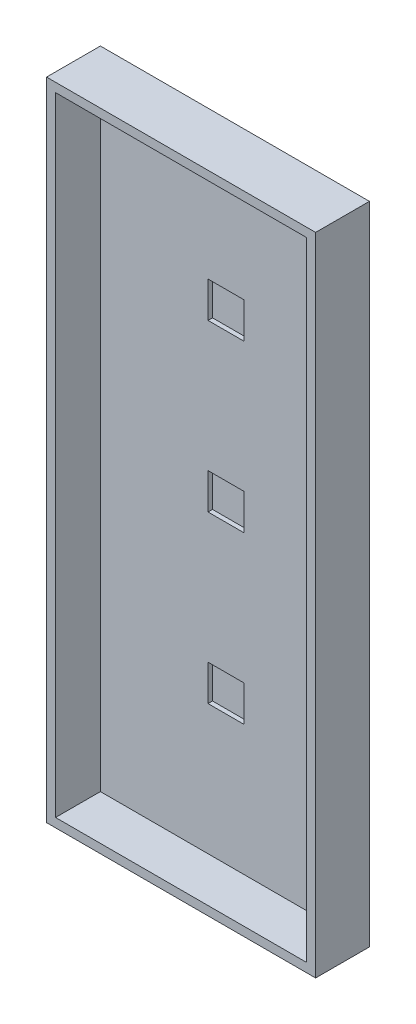
ISO-10303-21;
HEADER;
FILE_DESCRIPTION(('STEP AP214'),'2;1');
FILE_NAME('part.step','',(''),(''),'','','');
FILE_SCHEMA(('AUTOMOTIVE_DESIGN { 1 0 10303 214 1 1 1 1 }'));
ENDSEC;
DATA;
#1=APPLICATION_CONTEXT('core data for automotive mechanical design processes');
#2=APPLICATION_PROTOCOL_DEFINITION('international standard','automotive_design',2000,#1);
#3=PRODUCT_CONTEXT('',#1,'mechanical');
#4=PRODUCT('Part','Part','',(#3));
#5=PRODUCT_RELATED_PRODUCT_CATEGORY('part','',(#4));
#6=PRODUCT_DEFINITION_FORMATION('','',#4);
#7=PRODUCT_DEFINITION_CONTEXT('part definition',#1,'design');
#8=PRODUCT_DEFINITION('design','',#6,#7);
#9=PRODUCT_DEFINITION_SHAPE('','',#8);
#10=(LENGTH_UNIT() NAMED_UNIT(*) SI_UNIT(.MILLI.,.METRE.));
#11=(NAMED_UNIT(*) PLANE_ANGLE_UNIT() SI_UNIT($,.RADIAN.));
#12=(NAMED_UNIT(*) SI_UNIT($,.STERADIAN.) SOLID_ANGLE_UNIT());
#13=UNCERTAINTY_MEASURE_WITH_UNIT(LENGTH_MEASURE(1.E-05),#10,'distance_accuracy_value','');
#14=(GEOMETRIC_REPRESENTATION_CONTEXT(3) GLOBAL_UNCERTAINTY_ASSIGNED_CONTEXT((#13)) GLOBAL_UNIT_ASSIGNED_CONTEXT((#10,
#11,#12)) REPRESENTATION_CONTEXT('',''));
#15=CARTESIAN_POINT('',(0.,0.,0.));
#16=DIRECTION('',(0.,0.,1.));
#17=DIRECTION('',(1.,0.,0.));
#18=AXIS2_PLACEMENT_3D('',#15,#16,#17);
#19=CARTESIAN_POINT('',(-1879.70101962076,750.894148695731,152.4));
#20=DIRECTION('',(1.,0.,0.));
#21=DIRECTION('',(0.,0.,-1.));
#22=AXIS2_PLACEMENT_3D('',#19,#20,#21);
#23=PLANE('',#22);
#24=DIRECTION('',(0.,-1.,0.));
#25=VECTOR('',#24,1.);
#26=CARTESIAN_POINT('',(-1879.70101962076,750.894148695731,0.));
#27=LINE('',#26,#25);
#28=CARTESIAN_POINT('',(-1879.70101962076,750.894148695731,0.));
#29=VERTEX_POINT('',#28);
#30=CARTESIAN_POINT('',(-1879.70101962076,-1077.90585130427,0.));
#31=VERTEX_POINT('',#30);
#32=EDGE_CURVE('E293',#29,#31,#27,.T.);
#33=ORIENTED_EDGE('',*,*,#32,.T.);
#34=DIRECTION('',(0.,0.,-1.));
#35=VECTOR('',#34,1.);
#36=CARTESIAN_POINT('',(-1879.70101962076,-1077.90585130427,152.4));
#37=LINE('',#36,#35);
#38=CARTESIAN_POINT('',(-1879.70101962076,-1077.90585130427,152.4));
#39=VERTEX_POINT('',#38);
#40=EDGE_CURVE('E11',#39,#31,#37,.T.);
#41=ORIENTED_EDGE('',*,*,#40,.F.);
#42=DIRECTION('',(0.,-1.,0.));
#43=VECTOR('',#42,1.);
#44=CARTESIAN_POINT('',(-1879.70101962076,750.894148695731,152.4));
#45=LINE('',#44,#43);
#46=CARTESIAN_POINT('',(-1879.70101962076,750.894148695731,152.4));
#47=VERTEX_POINT('',#46);
#48=EDGE_CURVE('E300',#47,#39,#45,.T.);
#49=ORIENTED_EDGE('',*,*,#48,.F.);
#50=DIRECTION('',(0.,0.,-1.));
#51=VECTOR('',#50,1.);
#52=CARTESIAN_POINT('',(-1879.70101962076,750.894148695731,152.4));
#53=LINE('',#52,#51);
#54=EDGE_CURVE('E310',#47,#29,#53,.T.);
#55=ORIENTED_EDGE('',*,*,#54,.T.);
#56=EDGE_LOOP('',(#33,#41,#49,#55));
#57=FACE_BOUND('',#56,.T.);
#58=ADVANCED_FACE('F33',(#57),#23,.F.);
#59=CARTESIAN_POINT('',(-1879.70101962076,-1077.90585130427,152.4));
#60=DIRECTION('',(0.,1.,0.));
#61=DIRECTION('',(0.,0.,1.));
#62=AXIS2_PLACEMENT_3D('',#59,#60,#61);
#63=PLANE('',#62);
#64=DIRECTION('',(1.,0.,0.));
#65=VECTOR('',#64,1.);
#66=CARTESIAN_POINT('',(-1879.70101962076,-1077.90585130427,0.));
#67=LINE('',#66,#65);
#68=CARTESIAN_POINT('',(-1117.70101962076,-1077.90585130427,0.));
#69=VERTEX_POINT('',#68);
#70=EDGE_CURVE('E313',#31,#69,#67,.T.);
#71=ORIENTED_EDGE('',*,*,#70,.T.);
#72=DIRECTION('',(0.,0.,-1.));
#73=VECTOR('',#72,1.);
#74=CARTESIAN_POINT('',(-1117.70101962076,-1077.90585130427,152.4));
#75=LINE('',#74,#73);
#76=CARTESIAN_POINT('',(-1117.70101962076,-1077.90585130427,152.4));
#77=VERTEX_POINT('',#76);
#78=EDGE_CURVE('E40',#77,#69,#75,.T.);
#79=ORIENTED_EDGE('',*,*,#78,.F.);
#80=DIRECTION('',(1.,0.,0.));
#81=VECTOR('',#80,1.);
#82=CARTESIAN_POINT('',(-1879.70101962076,-1077.90585130427,152.4));
#83=LINE('',#82,#81);
#84=EDGE_CURVE('E303',#39,#77,#83,.T.);
#85=ORIENTED_EDGE('',*,*,#84,.F.);
#86=ORIENTED_EDGE('',*,*,#40,.T.);
#87=EDGE_LOOP('',(#71,#79,#85,#86));
#88=FACE_BOUND('',#87,.T.);
#89=ADVANCED_FACE('F343',(#88),#63,.F.);
#90=CARTESIAN_POINT('',(-1117.70101962076,750.894148695731,152.4));
#91=DIRECTION('',(-1.,0.,0.));
#92=DIRECTION('',(0.,0.,1.));
#93=AXIS2_PLACEMENT_3D('',#90,#91,#92);
#94=PLANE('',#93);
#95=DIRECTION('',(0.,1.,0.));
#96=VECTOR('',#95,1.);
#97=CARTESIAN_POINT('',(-1117.70101962076,750.894148695731,0.));
#98=LINE('',#97,#96);
#99=CARTESIAN_POINT('',(-1117.70101962076,750.894148695731,0.));
#100=VERTEX_POINT('',#99);
#101=EDGE_CURVE('E315',#69,#100,#98,.T.);
#102=ORIENTED_EDGE('',*,*,#101,.T.);
#103=DIRECTION('',(0.,0.,-1.));
#104=VECTOR('',#103,1.);
#105=CARTESIAN_POINT('',(-1117.70101962076,750.894148695731,152.4));
#106=LINE('',#105,#104);
#107=CARTESIAN_POINT('',(-1117.70101962076,750.894148695731,152.4));
#108=VERTEX_POINT('',#107);
#109=EDGE_CURVE('E320',#108,#100,#106,.T.);
#110=ORIENTED_EDGE('',*,*,#109,.F.);
#111=DIRECTION('',(0.,1.,0.));
#112=VECTOR('',#111,1.);
#113=CARTESIAN_POINT('',(-1117.70101962076,750.894148695731,152.4));
#114=LINE('',#113,#112);
#115=EDGE_CURVE('E306',#77,#108,#114,.T.);
#116=ORIENTED_EDGE('',*,*,#115,.F.);
#117=ORIENTED_EDGE('',*,*,#78,.T.);
#118=EDGE_LOOP('',(#102,#110,#116,#117));
#119=FACE_BOUND('',#118,.T.);
#120=ADVANCED_FACE('F327',(#119),#94,.F.);
#121=CARTESIAN_POINT('',(-1879.70101962076,750.894148695731,152.4));
#122=DIRECTION('',(0.,-1.,0.));
#123=DIRECTION('',(0.,0.,-1.));
#124=AXIS2_PLACEMENT_3D('',#121,#122,#123);
#125=PLANE('',#124);
#126=DIRECTION('',(-1.,0.,0.));
#127=VECTOR('',#126,1.);
#128=CARTESIAN_POINT('',(-1879.70101962076,750.894148695731,0.));
#129=LINE('',#128,#127);
#130=EDGE_CURVE('E304',#100,#29,#129,.T.);
#131=ORIENTED_EDGE('',*,*,#130,.T.);
#132=ORIENTED_EDGE('',*,*,#54,.F.);
#133=DIRECTION('',(-1.,0.,0.));
#134=VECTOR('',#133,1.);
#135=CARTESIAN_POINT('',(-1879.70101962076,750.894148695731,152.4));
#136=LINE('',#135,#134);
#137=EDGE_CURVE('E308',#108,#47,#136,.T.);
#138=ORIENTED_EDGE('',*,*,#137,.F.);
#139=ORIENTED_EDGE('',*,*,#109,.T.);
#140=EDGE_LOOP('',(#131,#132,#138,#139));
#141=FACE_BOUND('',#140,.T.);
#142=ADVANCED_FACE('F336',(#141),#125,.F.);
#143=CARTESIAN_POINT('',(0.,0.,152.4));
#144=DIRECTION('',(0.,0.,1.));
#145=DIRECTION('',(1.,0.,0.));
#146=AXIS2_PLACEMENT_3D('',#143,#144,#145);
#147=PLANE('',#146);
#148=DIRECTION('',(0.,-1.,0.));
#149=VECTOR('',#148,1.);
#150=CARTESIAN_POINT('',(-1854.30101962076,725.494148695731,152.4));
#151=LINE('',#150,#149);
#152=CARTESIAN_POINT('',(-1854.30101962076,725.494148695731,152.4));
#153=VERTEX_POINT('',#152);
#154=CARTESIAN_POINT('',(-1854.30101962076,-1052.50585130427,152.4));
#155=VERTEX_POINT('',#154);
#156=EDGE_CURVE('E205',#153,#155,#151,.T.);
#157=ORIENTED_EDGE('',*,*,#156,.F.);
#158=DIRECTION('',(1.,0.,0.));
#159=VECTOR('',#158,1.);
#160=CARTESIAN_POINT('',(-1854.30101962076,725.494148695731,152.4));
#161=LINE('',#160,#159);
#162=CARTESIAN_POINT('',(-1143.10101962076,725.494148695731,152.4));
#163=VERTEX_POINT('',#162);
#164=EDGE_CURVE('E274',#153,#163,#161,.T.);
#165=ORIENTED_EDGE('',*,*,#164,.T.);
#166=DIRECTION('',(0.,-1.,0.));
#167=VECTOR('',#166,1.);
#168=CARTESIAN_POINT('',(-1143.10101962076,725.494148695731,152.4));
#169=LINE('',#168,#167);
#170=CARTESIAN_POINT('',(-1143.10101962076,-1052.50585130427,152.4));
#171=VERTEX_POINT('',#170);
#172=EDGE_CURVE('E286',#163,#171,#169,.T.);
#173=ORIENTED_EDGE('',*,*,#172,.T.);
#174=DIRECTION('',(1.,0.,0.));
#175=VECTOR('',#174,1.);
#176=CARTESIAN_POINT('',(-1854.30101962076,-1052.50585130427,152.4));
#177=LINE('',#176,#175);
#178=EDGE_CURVE('E283',#155,#171,#177,.T.);
#179=ORIENTED_EDGE('',*,*,#178,.F.);
#180=EDGE_LOOP('',(#157,#165,#173,#179));
#181=FACE_BOUND('',#180,.T.);
#182=ORIENTED_EDGE('',*,*,#48,.T.);
#183=ORIENTED_EDGE('',*,*,#84,.T.);
#184=ORIENTED_EDGE('',*,*,#115,.T.);
#185=ORIENTED_EDGE('',*,*,#137,.T.);
#186=EDGE_LOOP('',(#182,#183,#184,#185));
#187=FACE_BOUND('',#186,.T.);
#188=ADVANCED_FACE('F342',(#181,#187),#147,.T.);
#189=CARTESIAN_POINT('',(0.,0.,0.));
#190=DIRECTION('',(0.,0.,1.));
#191=DIRECTION('',(1.,0.,0.));
#192=AXIS2_PLACEMENT_3D('',#189,#190,#191);
#193=PLANE('',#192);
#194=ORIENTED_EDGE('',*,*,#32,.F.);
#195=ORIENTED_EDGE('',*,*,#130,.F.);
#196=ORIENTED_EDGE('',*,*,#101,.F.);
#197=ORIENTED_EDGE('',*,*,#70,.F.);
#198=EDGE_LOOP('',(#194,#195,#196,#197));
#199=FACE_BOUND('',#198,.T.);
#200=ADVANCED_FACE('F333',(#199),#193,.F.);
#201=CARTESIAN_POINT('',(-1854.30101962076,725.494148695731,25.4));
#202=DIRECTION('',(-1.,0.,0.));
#203=DIRECTION('',(0.,-1.,0.));
#204=AXIS2_PLACEMENT_3D('',#201,#202,#203);
#205=PLANE('',#204);
#206=ORIENTED_EDGE('',*,*,#156,.T.);
#207=DIRECTION('',(0.,0.,1.));
#208=VECTOR('',#207,1.);
#209=CARTESIAN_POINT('',(-1854.30101962076,-1052.50585130427,25.4));
#210=LINE('',#209,#208);
#211=CARTESIAN_POINT('',(-1854.30101962076,-1052.50585130427,25.4));
#212=VERTEX_POINT('',#211);
#213=EDGE_CURVE('E281',#212,#155,#210,.T.);
#214=ORIENTED_EDGE('',*,*,#213,.F.);
#215=DIRECTION('',(0.,-1.,0.));
#216=VECTOR('',#215,1.);
#217=CARTESIAN_POINT('',(-1854.30101962076,725.494148695731,25.4));
#218=LINE('',#217,#216);
#219=CARTESIAN_POINT('',(-1854.30101962076,725.494148695731,25.4));
#220=VERTEX_POINT('',#219);
#221=EDGE_CURVE('E270',#220,#212,#218,.T.);
#222=ORIENTED_EDGE('',*,*,#221,.F.);
#223=DIRECTION('',(0.,0.,1.));
#224=VECTOR('',#223,1.);
#225=CARTESIAN_POINT('',(-1854.30101962076,725.494148695731,25.4));
#226=LINE('',#225,#224);
#227=EDGE_CURVE('E291',#220,#153,#226,.T.);
#228=ORIENTED_EDGE('',*,*,#227,.T.);
#229=EDGE_LOOP('',(#206,#214,#222,#228));
#230=FACE_BOUND('',#229,.T.);
#231=ADVANCED_FACE('F355',(#230),#205,.F.);
#232=CARTESIAN_POINT('',(-1854.30101962076,725.494148695731,25.4));
#233=DIRECTION('',(0.,-1.,0.));
#234=DIRECTION('',(0.,0.,-1.));
#235=AXIS2_PLACEMENT_3D('',#232,#233,#234);
#236=PLANE('',#235);
#237=ORIENTED_EDGE('',*,*,#164,.F.);
#238=ORIENTED_EDGE('',*,*,#227,.F.);
#239=DIRECTION('',(1.,0.,0.));
#240=VECTOR('',#239,1.);
#241=CARTESIAN_POINT('',(-1854.30101962076,725.494148695731,25.4));
#242=LINE('',#241,#240);
#243=CARTESIAN_POINT('',(-1143.10101962076,725.494148695731,25.4));
#244=VERTEX_POINT('',#243);
#245=EDGE_CURVE('E279',#220,#244,#242,.T.);
#246=ORIENTED_EDGE('',*,*,#245,.T.);
#247=DIRECTION('',(0.,0.,1.));
#248=VECTOR('',#247,1.);
#249=CARTESIAN_POINT('',(-1143.10101962076,725.494148695731,25.4));
#250=LINE('',#249,#248);
#251=EDGE_CURVE('E294',#244,#163,#250,.T.);
#252=ORIENTED_EDGE('',*,*,#251,.T.);
#253=EDGE_LOOP('',(#237,#238,#246,#252));
#254=FACE_BOUND('',#253,.T.);
#255=ADVANCED_FACE('F361',(#254),#236,.T.);
#256=CARTESIAN_POINT('',(-1143.10101962076,725.494148695731,25.4));
#257=DIRECTION('',(-1.,0.,0.));
#258=DIRECTION('',(0.,-1.,0.));
#259=AXIS2_PLACEMENT_3D('',#256,#257,#258);
#260=PLANE('',#259);
#261=ORIENTED_EDGE('',*,*,#172,.F.);
#262=ORIENTED_EDGE('',*,*,#251,.F.);
#263=DIRECTION('',(0.,-1.,0.));
#264=VECTOR('',#263,1.);
#265=CARTESIAN_POINT('',(-1143.10101962076,725.494148695731,25.4));
#266=LINE('',#265,#264);
#267=CARTESIAN_POINT('',(-1143.10101962076,-1052.50585130427,25.4));
#268=VERTEX_POINT('',#267);
#269=EDGE_CURVE('E277',#244,#268,#266,.T.);
#270=ORIENTED_EDGE('',*,*,#269,.T.);
#271=DIRECTION('',(0.,0.,1.));
#272=VECTOR('',#271,1.);
#273=CARTESIAN_POINT('',(-1143.10101962076,-1052.50585130427,25.4));
#274=LINE('',#273,#272);
#275=EDGE_CURVE('E296',#268,#171,#274,.T.);
#276=ORIENTED_EDGE('',*,*,#275,.T.);
#277=EDGE_LOOP('',(#261,#262,#270,#276));
#278=FACE_BOUND('',#277,.T.);
#279=ADVANCED_FACE('F367',(#278),#260,.T.);
#280=CARTESIAN_POINT('',(-1854.30101962076,-1052.50585130427,25.4));
#281=DIRECTION('',(0.,-1.,0.));
#282=DIRECTION('',(0.,0.,-1.));
#283=AXIS2_PLACEMENT_3D('',#280,#281,#282);
#284=PLANE('',#283);
#285=ORIENTED_EDGE('',*,*,#178,.T.);
#286=ORIENTED_EDGE('',*,*,#275,.F.);
#287=DIRECTION('',(1.,0.,0.));
#288=VECTOR('',#287,1.);
#289=CARTESIAN_POINT('',(-1854.30101962076,-1052.50585130427,25.4));
#290=LINE('',#289,#288);
#291=EDGE_CURVE('E273',#212,#268,#290,.T.);
#292=ORIENTED_EDGE('',*,*,#291,.F.);
#293=ORIENTED_EDGE('',*,*,#213,.T.);
#294=EDGE_LOOP('',(#285,#286,#292,#293));
#295=FACE_BOUND('',#294,.T.);
#296=ADVANCED_FACE('F363',(#295),#284,.F.);
#297=CARTESIAN_POINT('',(0.,0.,25.4));
#298=DIRECTION('',(0.,0.,1.));
#299=DIRECTION('',(1.,0.,0.));
#300=AXIS2_PLACEMENT_3D('',#297,#298,#299);
#301=PLANE('',#300);
#302=DIRECTION('',(0.,-1.,0.));
#303=VECTOR('',#302,1.);
#304=CARTESIAN_POINT('',(-1549.50101962076,357.194148695731,25.4));
#305=LINE('',#304,#303);
#306=CARTESIAN_POINT('',(-1549.50101962076,357.194148695731,25.4));
#307=VERTEX_POINT('',#306);
#308=CARTESIAN_POINT('',(-1549.50101962076,255.594148695731,25.4));
#309=VERTEX_POINT('',#308);
#310=EDGE_CURVE('E47',#307,#309,#305,.T.);
#311=ORIENTED_EDGE('',*,*,#310,.F.);
#312=DIRECTION('',(-1.,0.,0.));
#313=VECTOR('',#312,1.);
#314=CARTESIAN_POINT('',(-1549.50101962076,357.194148695731,25.4));
#315=LINE('',#314,#313);
#316=CARTESIAN_POINT('',(-1447.90101962076,357.194148695731,25.4));
#317=VERTEX_POINT('',#316);
#318=EDGE_CURVE('E189',#317,#307,#315,.T.);
#319=ORIENTED_EDGE('',*,*,#318,.F.);
#320=DIRECTION('',(0.,1.,0.));
#321=VECTOR('',#320,1.);
#322=CARTESIAN_POINT('',(-1447.90101962076,357.194148695731,25.4));
#323=LINE('',#322,#321);
#324=CARTESIAN_POINT('',(-1447.90101962076,255.594148695731,25.4));
#325=VERTEX_POINT('',#324);
#326=EDGE_CURVE('E192',#325,#317,#323,.T.);
#327=ORIENTED_EDGE('',*,*,#326,.F.);
#328=DIRECTION('',(1.,0.,0.));
#329=VECTOR('',#328,1.);
#330=CARTESIAN_POINT('',(-1549.50101962076,255.594148695731,25.4));
#331=LINE('',#330,#329);
#332=EDGE_CURVE('E198',#309,#325,#331,.T.);
#333=ORIENTED_EDGE('',*,*,#332,.F.);
#334=EDGE_LOOP('',(#311,#319,#327,#333));
#335=FACE_BOUND('',#334,.T.);
#336=DIRECTION('',(-1.,0.,0.));
#337=VECTOR('',#336,1.);
#338=CARTESIAN_POINT('',(-1549.50101962075,-112.705851304269,25.4));
#339=LINE('',#338,#337);
#340=CARTESIAN_POINT('',(-1447.90101962075,-112.705851304269,25.4));
#341=VERTEX_POINT('',#340);
#342=CARTESIAN_POINT('',(-1549.50101962075,-112.705851304269,25.4));
#343=VERTEX_POINT('',#342);
#344=EDGE_CURVE('E55',#341,#343,#339,.T.);
#345=ORIENTED_EDGE('',*,*,#344,.F.);
#346=DIRECTION('',(0.,1.,0.));
#347=VECTOR('',#346,1.);
#348=CARTESIAN_POINT('',(-1447.90101962075,-112.705851304269,25.4));
#349=LINE('',#348,#347);
#350=CARTESIAN_POINT('',(-1447.90101962075,-214.305851304269,25.4));
#351=VERTEX_POINT('',#350);
#352=EDGE_CURVE('E213',#351,#341,#349,.T.);
#353=ORIENTED_EDGE('',*,*,#352,.F.);
#354=DIRECTION('',(1.,0.,0.));
#355=VECTOR('',#354,1.);
#356=CARTESIAN_POINT('',(-1549.50101962075,-214.305851304269,25.4));
#357=LINE('',#356,#355);
#358=CARTESIAN_POINT('',(-1549.50101962075,-214.305851304269,25.4));
#359=VERTEX_POINT('',#358);
#360=EDGE_CURVE('E228',#359,#351,#357,.T.);
#361=ORIENTED_EDGE('',*,*,#360,.F.);
#362=DIRECTION('',(0.,-1.,0.));
#363=VECTOR('',#362,1.);
#364=CARTESIAN_POINT('',(-1549.50101962075,-112.705851304269,25.4));
#365=LINE('',#364,#363);
#366=EDGE_CURVE('E224',#343,#359,#365,.T.);
#367=ORIENTED_EDGE('',*,*,#366,.F.);
#368=EDGE_LOOP('',(#345,#353,#361,#367));
#369=FACE_BOUND('',#368,.T.);
#370=DIRECTION('',(-1.,0.,0.));
#371=VECTOR('',#370,1.);
#372=CARTESIAN_POINT('',(-1549.50101962075,-582.605851304269,25.4));
#373=LINE('',#372,#371);
#374=CARTESIAN_POINT('',(-1447.90101962075,-582.605851304269,25.4));
#375=VERTEX_POINT('',#374);
#376=CARTESIAN_POINT('',(-1549.50101962075,-582.605851304269,25.4));
#377=VERTEX_POINT('',#376);
#378=EDGE_CURVE('E253',#375,#377,#373,.T.);
#379=ORIENTED_EDGE('',*,*,#378,.F.);
#380=DIRECTION('',(0.,1.,0.));
#381=VECTOR('',#380,1.);
#382=CARTESIAN_POINT('',(-1447.90101962075,-582.605851304269,25.4));
#383=LINE('',#382,#381);
#384=CARTESIAN_POINT('',(-1447.90101962075,-684.205851304269,25.4));
#385=VERTEX_POINT('',#384);
#386=EDGE_CURVE('E243',#385,#375,#383,.T.);
#387=ORIENTED_EDGE('',*,*,#386,.F.);
#388=DIRECTION('',(1.,0.,0.));
#389=VECTOR('',#388,1.);
#390=CARTESIAN_POINT('',(-1549.50101962075,-684.205851304269,25.4));
#391=LINE('',#390,#389);
#392=CARTESIAN_POINT('',(-1549.50101962075,-684.205851304269,25.4));
#393=VERTEX_POINT('',#392);
#394=EDGE_CURVE('E258',#393,#385,#391,.T.);
#395=ORIENTED_EDGE('',*,*,#394,.F.);
#396=DIRECTION('',(0.,-1.,0.));
#397=VECTOR('',#396,1.);
#398=CARTESIAN_POINT('',(-1549.50101962075,-582.605851304269,25.4));
#399=LINE('',#398,#397);
#400=EDGE_CURVE('E255',#377,#393,#399,.T.);
#401=ORIENTED_EDGE('',*,*,#400,.F.);
#402=EDGE_LOOP('',(#379,#387,#395,#401));
#403=FACE_BOUND('',#402,.T.);
#404=ORIENTED_EDGE('',*,*,#221,.T.);
#405=ORIENTED_EDGE('',*,*,#291,.T.);
#406=ORIENTED_EDGE('',*,*,#269,.F.);
#407=ORIENTED_EDGE('',*,*,#245,.F.);
#408=EDGE_LOOP('',(#404,#405,#406,#407));
#409=FACE_BOUND('',#408,.T.);
#410=ADVANCED_FACE('F366',(#335,#369,#403,#409),#301,.T.);
#411=CARTESIAN_POINT('',(-1549.50101962075,-582.605851304269,12.7));
#412=DIRECTION('',(0.,1.,0.));
#413=DIRECTION('',(0.,0.,1.));
#414=AXIS2_PLACEMENT_3D('',#411,#412,#413);
#415=PLANE('',#414);
#416=ORIENTED_EDGE('',*,*,#378,.T.);
#417=DIRECTION('',(0.,0.,1.));
#418=VECTOR('',#417,1.);
#419=CARTESIAN_POINT('',(-1549.50101962075,-582.605851304269,12.7));
#420=LINE('',#419,#418);
#421=CARTESIAN_POINT('',(-1549.50101962075,-582.605851304269,12.7));
#422=VERTEX_POINT('',#421);
#423=EDGE_CURVE('E252',#422,#377,#420,.T.);
#424=ORIENTED_EDGE('',*,*,#423,.F.);
#425=DIRECTION('',(-1.,0.,0.));
#426=VECTOR('',#425,1.);
#427=CARTESIAN_POINT('',(-1549.50101962075,-582.605851304269,12.7));
#428=LINE('',#427,#426);
#429=CARTESIAN_POINT('',(-1447.90101962075,-582.605851304269,12.7));
#430=VERTEX_POINT('',#429);
#431=EDGE_CURVE('E239',#430,#422,#428,.T.);
#432=ORIENTED_EDGE('',*,*,#431,.F.);
#433=DIRECTION('',(0.,0.,1.));
#434=VECTOR('',#433,1.);
#435=CARTESIAN_POINT('',(-1447.90101962075,-582.605851304269,12.7));
#436=LINE('',#435,#434);
#437=EDGE_CURVE('E225',#430,#375,#436,.T.);
#438=ORIENTED_EDGE('',*,*,#437,.T.);
#439=EDGE_LOOP('',(#416,#424,#432,#438));
#440=FACE_BOUND('',#439,.T.);
#441=ADVANCED_FACE('F377',(#440),#415,.F.);
#442=CARTESIAN_POINT('',(-1447.90101962075,-582.605851304269,12.7));
#443=DIRECTION('',(1.,0.,0.));
#444=DIRECTION('',(0.,0.,-1.));
#445=AXIS2_PLACEMENT_3D('',#442,#443,#444);
#446=PLANE('',#445);
#447=ORIENTED_EDGE('',*,*,#386,.T.);
#448=ORIENTED_EDGE('',*,*,#437,.F.);
#449=DIRECTION('',(0.,1.,0.));
#450=VECTOR('',#449,1.);
#451=CARTESIAN_POINT('',(-1447.90101962075,-582.605851304269,12.7));
#452=LINE('',#451,#450);
#453=CARTESIAN_POINT('',(-1447.90101962075,-684.205851304269,12.7));
#454=VERTEX_POINT('',#453);
#455=EDGE_CURVE('E249',#454,#430,#452,.T.);
#456=ORIENTED_EDGE('',*,*,#455,.F.);
#457=DIRECTION('',(0.,0.,1.));
#458=VECTOR('',#457,1.);
#459=CARTESIAN_POINT('',(-1447.90101962075,-684.205851304269,12.7));
#460=LINE('',#459,#458);
#461=EDGE_CURVE('E264',#454,#385,#460,.T.);
#462=ORIENTED_EDGE('',*,*,#461,.T.);
#463=EDGE_LOOP('',(#447,#448,#456,#462));
#464=FACE_BOUND('',#463,.T.);
#465=ADVANCED_FACE('F381',(#464),#446,.F.);
#466=CARTESIAN_POINT('',(-1549.50101962075,-684.205851304269,12.7));
#467=DIRECTION('',(0.,-1.,0.));
#468=DIRECTION('',(0.,0.,-1.));
#469=AXIS2_PLACEMENT_3D('',#466,#467,#468);
#470=PLANE('',#469);
#471=ORIENTED_EDGE('',*,*,#394,.T.);
#472=ORIENTED_EDGE('',*,*,#461,.F.);
#473=DIRECTION('',(1.,0.,0.));
#474=VECTOR('',#473,1.);
#475=CARTESIAN_POINT('',(-1549.50101962075,-684.205851304269,12.7));
#476=LINE('',#475,#474);
#477=CARTESIAN_POINT('',(-1549.50101962075,-684.205851304269,12.7));
#478=VERTEX_POINT('',#477);
#479=EDGE_CURVE('E246',#478,#454,#476,.T.);
#480=ORIENTED_EDGE('',*,*,#479,.F.);
#481=DIRECTION('',(0.,0.,1.));
#482=VECTOR('',#481,1.);
#483=CARTESIAN_POINT('',(-1549.50101962075,-684.205851304269,12.7));
#484=LINE('',#483,#482);
#485=EDGE_CURVE('E266',#478,#393,#484,.T.);
#486=ORIENTED_EDGE('',*,*,#485,.T.);
#487=EDGE_LOOP('',(#471,#472,#480,#486));
#488=FACE_BOUND('',#487,.T.);
#489=ADVANCED_FACE('F387',(#488),#470,.F.);
#490=CARTESIAN_POINT('',(-1549.50101962075,-582.605851304269,12.7));
#491=DIRECTION('',(-1.,0.,0.));
#492=DIRECTION('',(0.,0.,1.));
#493=AXIS2_PLACEMENT_3D('',#490,#491,#492);
#494=PLANE('',#493);
#495=ORIENTED_EDGE('',*,*,#400,.T.);
#496=ORIENTED_EDGE('',*,*,#485,.F.);
#497=DIRECTION('',(0.,-1.,0.));
#498=VECTOR('',#497,1.);
#499=CARTESIAN_POINT('',(-1549.50101962075,-582.605851304269,12.7));
#500=LINE('',#499,#498);
#501=EDGE_CURVE('E242',#422,#478,#500,.T.);
#502=ORIENTED_EDGE('',*,*,#501,.F.);
#503=ORIENTED_EDGE('',*,*,#423,.T.);
#504=EDGE_LOOP('',(#495,#496,#502,#503));
#505=FACE_BOUND('',#504,.T.);
#506=ADVANCED_FACE('F383',(#505),#494,.F.);
#507=CARTESIAN_POINT('',(0.,0.,12.7));
#508=DIRECTION('',(0.,0.,-1.));
#509=DIRECTION('',(-1.,0.,0.));
#510=AXIS2_PLACEMENT_3D('',#507,#508,#509);
#511=PLANE('',#510);
#512=ORIENTED_EDGE('',*,*,#431,.T.);
#513=ORIENTED_EDGE('',*,*,#501,.T.);
#514=ORIENTED_EDGE('',*,*,#479,.T.);
#515=ORIENTED_EDGE('',*,*,#455,.T.);
#516=EDGE_LOOP('',(#512,#513,#514,#515));
#517=FACE_BOUND('',#516,.T.);
#518=ADVANCED_FACE('F386',(#517),#511,.F.);
#519=CARTESIAN_POINT('',(-1549.50101962075,-112.705851304269,12.7));
#520=DIRECTION('',(0.,1.,0.));
#521=DIRECTION('',(0.,0.,1.));
#522=AXIS2_PLACEMENT_3D('',#519,#520,#521);
#523=PLANE('',#522);
#524=ORIENTED_EDGE('',*,*,#344,.T.);
#525=DIRECTION('',(0.,0.,1.));
#526=VECTOR('',#525,1.);
#527=CARTESIAN_POINT('',(-1549.50101962075,-112.705851304269,12.7));
#528=LINE('',#527,#526);
#529=CARTESIAN_POINT('',(-1549.50101962075,-112.705851304269,12.7));
#530=VERTEX_POINT('',#529);
#531=EDGE_CURVE('E222',#530,#343,#528,.T.);
#532=ORIENTED_EDGE('',*,*,#531,.F.);
#533=DIRECTION('',(-1.,0.,0.));
#534=VECTOR('',#533,1.);
#535=CARTESIAN_POINT('',(-1549.50101962075,-112.705851304269,12.7));
#536=LINE('',#535,#534);
#537=CARTESIAN_POINT('',(-1447.90101962075,-112.705851304269,12.7));
#538=VERTEX_POINT('',#537);
#539=EDGE_CURVE('E209',#538,#530,#536,.T.);
#540=ORIENTED_EDGE('',*,*,#539,.F.);
#541=DIRECTION('',(0.,0.,1.));
#542=VECTOR('',#541,1.);
#543=CARTESIAN_POINT('',(-1447.90101962075,-112.705851304269,12.7));
#544=LINE('',#543,#542);
#545=EDGE_CURVE('E199',#538,#341,#544,.T.);
#546=ORIENTED_EDGE('',*,*,#545,.T.);
#547=EDGE_LOOP('',(#524,#532,#540,#546));
#548=FACE_BOUND('',#547,.T.);
#549=ADVANCED_FACE('F397',(#548),#523,.F.);
#550=CARTESIAN_POINT('',(-1447.90101962075,-112.705851304269,12.7));
#551=DIRECTION('',(1.,0.,0.));
#552=DIRECTION('',(0.,0.,-1.));
#553=AXIS2_PLACEMENT_3D('',#550,#551,#552);
#554=PLANE('',#553);
#555=ORIENTED_EDGE('',*,*,#352,.T.);
#556=ORIENTED_EDGE('',*,*,#545,.F.);
#557=DIRECTION('',(0.,1.,0.));
#558=VECTOR('',#557,1.);
#559=CARTESIAN_POINT('',(-1447.90101962075,-112.705851304269,12.7));
#560=LINE('',#559,#558);
#561=CARTESIAN_POINT('',(-1447.90101962075,-214.305851304269,12.7));
#562=VERTEX_POINT('',#561);
#563=EDGE_CURVE('E219',#562,#538,#560,.T.);
#564=ORIENTED_EDGE('',*,*,#563,.F.);
#565=DIRECTION('',(0.,0.,1.));
#566=VECTOR('',#565,1.);
#567=CARTESIAN_POINT('',(-1447.90101962075,-214.305851304269,12.7));
#568=LINE('',#567,#566);
#569=EDGE_CURVE('E234',#562,#351,#568,.T.);
#570=ORIENTED_EDGE('',*,*,#569,.T.);
#571=EDGE_LOOP('',(#555,#556,#564,#570));
#572=FACE_BOUND('',#571,.T.);
#573=ADVANCED_FACE('F401',(#572),#554,.F.);
#574=CARTESIAN_POINT('',(-1549.50101962075,-214.305851304269,12.7));
#575=DIRECTION('',(0.,-1.,0.));
#576=DIRECTION('',(0.,0.,-1.));
#577=AXIS2_PLACEMENT_3D('',#574,#575,#576);
#578=PLANE('',#577);
#579=ORIENTED_EDGE('',*,*,#360,.T.);
#580=ORIENTED_EDGE('',*,*,#569,.F.);
#581=DIRECTION('',(1.,0.,0.));
#582=VECTOR('',#581,1.);
#583=CARTESIAN_POINT('',(-1549.50101962075,-214.305851304269,12.7));
#584=LINE('',#583,#582);
#585=CARTESIAN_POINT('',(-1549.50101962075,-214.305851304269,12.7));
#586=VERTEX_POINT('',#585);
#587=EDGE_CURVE('E216',#586,#562,#584,.T.);
#588=ORIENTED_EDGE('',*,*,#587,.F.);
#589=DIRECTION('',(0.,0.,1.));
#590=VECTOR('',#589,1.);
#591=CARTESIAN_POINT('',(-1549.50101962075,-214.305851304269,12.7));
#592=LINE('',#591,#590);
#593=EDGE_CURVE('E236',#586,#359,#592,.T.);
#594=ORIENTED_EDGE('',*,*,#593,.T.);
#595=EDGE_LOOP('',(#579,#580,#588,#594));
#596=FACE_BOUND('',#595,.T.);
#597=ADVANCED_FACE('F406',(#596),#578,.F.);
#598=CARTESIAN_POINT('',(-1549.50101962075,-112.705851304269,12.7));
#599=DIRECTION('',(-1.,0.,0.));
#600=DIRECTION('',(0.,0.,1.));
#601=AXIS2_PLACEMENT_3D('',#598,#599,#600);
#602=PLANE('',#601);
#603=ORIENTED_EDGE('',*,*,#366,.T.);
#604=ORIENTED_EDGE('',*,*,#593,.F.);
#605=DIRECTION('',(0.,-1.,0.));
#606=VECTOR('',#605,1.);
#607=CARTESIAN_POINT('',(-1549.50101962075,-112.705851304269,12.7));
#608=LINE('',#607,#606);
#609=EDGE_CURVE('E212',#530,#586,#608,.T.);
#610=ORIENTED_EDGE('',*,*,#609,.F.);
#611=ORIENTED_EDGE('',*,*,#531,.T.);
#612=EDGE_LOOP('',(#603,#604,#610,#611));
#613=FACE_BOUND('',#612,.T.);
#614=ADVANCED_FACE('F402',(#613),#602,.F.);
#615=CARTESIAN_POINT('',(0.,0.,12.7));
#616=DIRECTION('',(0.,0.,-1.));
#617=DIRECTION('',(-1.,0.,0.));
#618=AXIS2_PLACEMENT_3D('',#615,#616,#617);
#619=PLANE('',#618);
#620=ORIENTED_EDGE('',*,*,#539,.T.);
#621=ORIENTED_EDGE('',*,*,#609,.T.);
#622=ORIENTED_EDGE('',*,*,#587,.T.);
#623=ORIENTED_EDGE('',*,*,#563,.T.);
#624=EDGE_LOOP('',(#620,#621,#622,#623));
#625=FACE_BOUND('',#624,.T.);
#626=ADVANCED_FACE('F405',(#625),#619,.F.);
#627=CARTESIAN_POINT('',(-1549.50101962076,357.194148695731,12.7));
#628=DIRECTION('',(-1.,0.,0.));
#629=DIRECTION('',(0.,0.,1.));
#630=AXIS2_PLACEMENT_3D('',#627,#628,#629);
#631=PLANE('',#630);
#632=ORIENTED_EDGE('',*,*,#310,.T.);
#633=DIRECTION('',(0.,0.,1.));
#634=VECTOR('',#633,1.);
#635=CARTESIAN_POINT('',(-1549.50101962076,255.594148695731,12.7));
#636=LINE('',#635,#634);
#637=CARTESIAN_POINT('',(-1549.50101962076,255.594148695731,12.7));
#638=VERTEX_POINT('',#637);
#639=EDGE_CURVE('E167',#638,#309,#636,.T.);
#640=ORIENTED_EDGE('',*,*,#639,.F.);
#641=DIRECTION('',(0.,-1.,0.));
#642=VECTOR('',#641,1.);
#643=CARTESIAN_POINT('',(-1549.50101962076,357.194148695731,12.7));
#644=LINE('',#643,#642);
#645=CARTESIAN_POINT('',(-1549.50101962076,357.194148695731,12.7));
#646=VERTEX_POINT('',#645);
#647=EDGE_CURVE('E171',#646,#638,#644,.T.);
#648=ORIENTED_EDGE('',*,*,#647,.F.);
#649=DIRECTION('',(0.,0.,1.));
#650=VECTOR('',#649,1.);
#651=CARTESIAN_POINT('',(-1549.50101962076,357.194148695731,12.7));
#652=LINE('',#651,#650);
#653=EDGE_CURVE('E203',#646,#307,#652,.T.);
#654=ORIENTED_EDGE('',*,*,#653,.T.);
#655=EDGE_LOOP('',(#632,#640,#648,#654));
#656=FACE_BOUND('',#655,.T.);
#657=ADVANCED_FACE('F169',(#656),#631,.F.);
#658=CARTESIAN_POINT('',(-1549.50101962076,357.194148695731,12.7));
#659=DIRECTION('',(0.,1.,0.));
#660=DIRECTION('',(0.,0.,1.));
#661=AXIS2_PLACEMENT_3D('',#658,#659,#660);
#662=PLANE('',#661);
#663=ORIENTED_EDGE('',*,*,#318,.T.);
#664=ORIENTED_EDGE('',*,*,#653,.F.);
#665=DIRECTION('',(-1.,0.,0.));
#666=VECTOR('',#665,1.);
#667=CARTESIAN_POINT('',(-1549.50101962076,357.194148695731,12.7));
#668=LINE('',#667,#666);
#669=CARTESIAN_POINT('',(-1447.90101962076,357.194148695731,12.7));
#670=VERTEX_POINT('',#669);
#671=EDGE_CURVE('E177',#670,#646,#668,.T.);
#672=ORIENTED_EDGE('',*,*,#671,.F.);
#673=DIRECTION('',(0.,0.,1.));
#674=VECTOR('',#673,1.);
#675=CARTESIAN_POINT('',(-1447.90101962076,357.194148695731,12.7));
#676=LINE('',#675,#674);
#677=EDGE_CURVE('E206',#670,#317,#676,.T.);
#678=ORIENTED_EDGE('',*,*,#677,.T.);
#679=EDGE_LOOP('',(#663,#664,#672,#678));
#680=FACE_BOUND('',#679,.T.);
#681=ADVANCED_FACE('F419',(#680),#662,.F.);
#682=CARTESIAN_POINT('',(-1447.90101962076,357.194148695731,12.7));
#683=DIRECTION('',(1.,0.,0.));
#684=DIRECTION('',(0.,0.,-1.));
#685=AXIS2_PLACEMENT_3D('',#682,#683,#684);
#686=PLANE('',#685);
#687=ORIENTED_EDGE('',*,*,#326,.T.);
#688=ORIENTED_EDGE('',*,*,#677,.F.);
#689=DIRECTION('',(0.,1.,0.));
#690=VECTOR('',#689,1.);
#691=CARTESIAN_POINT('',(-1447.90101962076,357.194148695731,12.7));
#692=LINE('',#691,#690);
#693=CARTESIAN_POINT('',(-1447.90101962076,255.594148695731,12.7));
#694=VERTEX_POINT('',#693);
#695=EDGE_CURVE('E185',#694,#670,#692,.T.);
#696=ORIENTED_EDGE('',*,*,#695,.F.);
#697=DIRECTION('',(0.,0.,1.));
#698=VECTOR('',#697,1.);
#699=CARTESIAN_POINT('',(-1447.90101962076,255.594148695731,12.7));
#700=LINE('',#699,#698);
#701=EDGE_CURVE('E176',#694,#325,#700,.T.);
#702=ORIENTED_EDGE('',*,*,#701,.T.);
#703=EDGE_LOOP('',(#687,#688,#696,#702));
#704=FACE_BOUND('',#703,.T.);
#705=ADVANCED_FACE('F422',(#704),#686,.F.);
#706=CARTESIAN_POINT('',(-1549.50101962076,255.594148695731,12.7));
#707=DIRECTION('',(0.,-1.,0.));
#708=DIRECTION('',(0.,0.,-1.));
#709=AXIS2_PLACEMENT_3D('',#706,#707,#708);
#710=PLANE('',#709);
#711=ORIENTED_EDGE('',*,*,#332,.T.);
#712=ORIENTED_EDGE('',*,*,#701,.F.);
#713=DIRECTION('',(1.,0.,0.));
#714=VECTOR('',#713,1.);
#715=CARTESIAN_POINT('',(-1549.50101962076,255.594148695731,12.7));
#716=LINE('',#715,#714);
#717=EDGE_CURVE('E180',#638,#694,#716,.T.);
#718=ORIENTED_EDGE('',*,*,#717,.F.);
#719=ORIENTED_EDGE('',*,*,#639,.T.);
#720=EDGE_LOOP('',(#711,#712,#718,#719));
#721=FACE_BOUND('',#720,.T.);
#722=ADVANCED_FACE('F181',(#721),#710,.F.);
#723=CARTESIAN_POINT('',(0.,0.,12.7));
#724=DIRECTION('',(0.,0.,1.));
#725=DIRECTION('',(1.,0.,0.));
#726=AXIS2_PLACEMENT_3D('',#723,#724,#725);
#727=PLANE('',#726);
#728=ORIENTED_EDGE('',*,*,#647,.T.);
#729=ORIENTED_EDGE('',*,*,#717,.T.);
#730=ORIENTED_EDGE('',*,*,#695,.T.);
#731=ORIENTED_EDGE('',*,*,#671,.T.);
#732=EDGE_LOOP('',(#728,#729,#730,#731));
#733=FACE_BOUND('',#732,.T.);
#734=ADVANCED_FACE('F187',(#733),#727,.T.);
#735=CLOSED_SHELL('',(#58,#89,#120,#142,#188,#200,#231,#255,#279,#296,#410,#441,#465,#489,#506,
#518,#549,#573,#597,#614,#626,#657,#681,#705,#722,#734));
#736=MANIFOLD_SOLID_BREP('B2',#735);
#737=ADVANCED_BREP_SHAPE_REPRESENTATION('',(#18,#736),#14);
#738=SHAPE_DEFINITION_REPRESENTATION(#9,#737);
ENDSEC;
END-ISO-10303-21;
